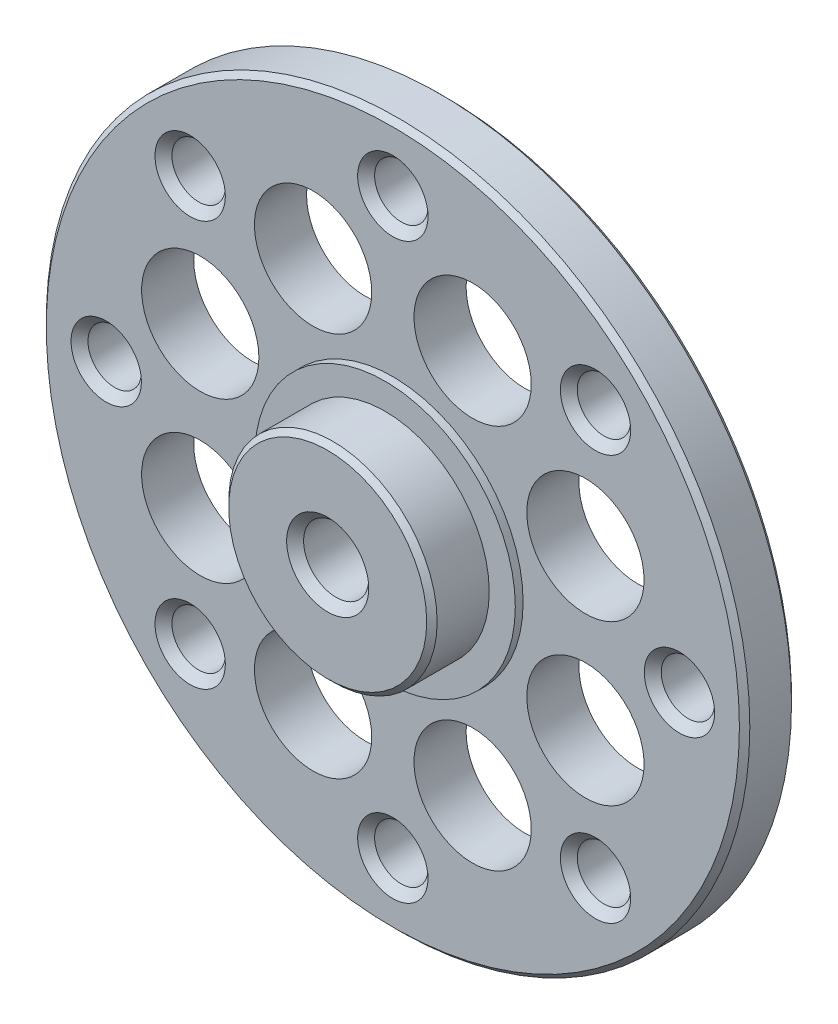
ISO-10303-21;
HEADER;
FILE_DESCRIPTION(('STEP AP214'),'2;1');
FILE_NAME('part.step','',(''),(''),'','','');
FILE_SCHEMA(('AUTOMOTIVE_DESIGN { 1 0 10303 214 1 1 1 1 }'));
ENDSEC;
DATA;
#1=APPLICATION_CONTEXT('core data for automotive mechanical design processes');
#2=APPLICATION_PROTOCOL_DEFINITION('international standard','automotive_design',2000,#1);
#3=PRODUCT_CONTEXT('',#1,'mechanical');
#4=PRODUCT('Part','Part','',(#3));
#5=PRODUCT_RELATED_PRODUCT_CATEGORY('part','',(#4));
#6=PRODUCT_DEFINITION_FORMATION('','',#4);
#7=PRODUCT_DEFINITION_CONTEXT('part definition',#1,'design');
#8=PRODUCT_DEFINITION('design','',#6,#7);
#9=PRODUCT_DEFINITION_SHAPE('','',#8);
#10=(LENGTH_UNIT() NAMED_UNIT(*) SI_UNIT(.MILLI.,.METRE.));
#11=(NAMED_UNIT(*) PLANE_ANGLE_UNIT() SI_UNIT($,.RADIAN.));
#12=(NAMED_UNIT(*) SI_UNIT($,.STERADIAN.) SOLID_ANGLE_UNIT());
#13=UNCERTAINTY_MEASURE_WITH_UNIT(LENGTH_MEASURE(1.E-05),#10,'distance_accuracy_value','');
#14=(GEOMETRIC_REPRESENTATION_CONTEXT(3) GLOBAL_UNCERTAINTY_ASSIGNED_CONTEXT((#13)) GLOBAL_UNIT_ASSIGNED_CONTEXT((#10,
#11,#12)) REPRESENTATION_CONTEXT('',''));
#15=CARTESIAN_POINT('',(0.,0.,0.));
#16=DIRECTION('',(0.,0.,1.));
#17=DIRECTION('',(1.,0.,0.));
#18=AXIS2_PLACEMENT_3D('',#15,#16,#17);
#19=CARTESIAN_POINT('',(0.,0.,0.));
#20=DIRECTION('',(0.,0.,1.));
#21=DIRECTION('',(1.,0.,0.));
#22=AXIS2_PLACEMENT_3D('',#19,#20,#21);
#23=CYLINDRICAL_SURFACE('',#22,13.5);
#24=CARTESIAN_POINT('',(0.,0.,1.79999884909628));
#25=DIRECTION('',(0.,0.,1.));
#26=DIRECTION('',(1.,0.,0.));
#27=AXIS2_PLACEMENT_3D('',#24,#25,#26);
#28=CIRCLE('',#27,13.5);
#29=CARTESIAN_POINT('',(13.5,0.,1.79999884909628));
#30=VERTEX_POINT('',#29);
#31=EDGE_CURVE('E56',#30,#30,#28,.F.);
#32=ORIENTED_EDGE('',*,*,#31,.T.);
#33=EDGE_LOOP('',(#32));
#34=FACE_BOUND('',#33,.T.);
#35=CARTESIAN_POINT('',(0.,0.,0.200001176919797));
#36=DIRECTION('',(0.,0.,-1.));
#37=DIRECTION('',(-1.,0.,0.));
#38=AXIS2_PLACEMENT_3D('',#35,#36,#37);
#39=CIRCLE('',#38,13.5);
#40=CARTESIAN_POINT('',(-13.5,0.,0.200001176919797));
#41=VERTEX_POINT('',#40);
#42=EDGE_CURVE('E59',#41,#41,#39,.F.);
#43=ORIENTED_EDGE('',*,*,#42,.T.);
#44=EDGE_LOOP('',(#43));
#45=FACE_BOUND('',#44,.T.);
#46=ADVANCED_FACE('F33',(#34,#45),#23,.T.);
#47=CARTESIAN_POINT('',(13.5,0.,0.));
#48=DIRECTION('',(0.,0.,-1.));
#49=DIRECTION('',(-1.,0.,0.));
#50=AXIS2_PLACEMENT_3D('',#47,#48,#49);
#51=PLANE('',#50);
#52=CARTESIAN_POINT('',(0.,0.,0.));
#53=DIRECTION('',(0.,0.,-1.));
#54=DIRECTION('',(-1.,0.,0.));
#55=AXIS2_PLACEMENT_3D('',#52,#53,#54);
#56=CIRCLE('',#55,13.2999988490963);
#57=CARTESIAN_POINT('',(-13.2999988490963,0.,0.));
#58=VERTEX_POINT('',#57);
#59=EDGE_CURVE('E53',#58,#58,#56,.T.);
#60=ORIENTED_EDGE('',*,*,#59,.T.);
#61=EDGE_LOOP('',(#60));
#62=FACE_BOUND('',#61,.T.);
#63=CARTESIAN_POINT('',(7.778174593052,7.778174593052,0.));
#64=DIRECTION('',(0.,0.,-1.));
#65=DIRECTION('',(-1.,0.,0.));
#66=AXIS2_PLACEMENT_3D('',#63,#64,#65);
#67=CIRCLE('',#66,1.02499999999999);
#68=CARTESIAN_POINT('',(6.75317459305201,7.778174593052,0.));
#69=VERTEX_POINT('',#68);
#70=EDGE_CURVE('E124',#69,#69,#67,.T.);
#71=ORIENTED_EDGE('',*,*,#70,.F.);
#72=EDGE_LOOP('',(#71));
#73=FACE_BOUND('',#72,.T.);
#74=CARTESIAN_POINT('',(11.,0.,0.));
#75=DIRECTION('',(0.,0.,-1.));
#76=DIRECTION('',(-1.,0.,0.));
#77=AXIS2_PLACEMENT_3D('',#74,#75,#76);
#78=CIRCLE('',#77,1.02499999999999);
#79=CARTESIAN_POINT('',(9.97500000000001,0.,0.));
#80=VERTEX_POINT('',#79);
#81=EDGE_CURVE('E120',#80,#80,#78,.T.);
#82=ORIENTED_EDGE('',*,*,#81,.F.);
#83=EDGE_LOOP('',(#82));
#84=FACE_BOUND('',#83,.T.);
#85=CARTESIAN_POINT('',(7.778174593052,-7.778174593052,0.));
#86=DIRECTION('',(0.,0.,-1.));
#87=DIRECTION('',(-1.,0.,0.));
#88=AXIS2_PLACEMENT_3D('',#85,#86,#87);
#89=CIRCLE('',#88,1.02499999999999);
#90=CARTESIAN_POINT('',(6.75317459305201,-7.778174593052,0.));
#91=VERTEX_POINT('',#90);
#92=EDGE_CURVE('E123',#91,#91,#89,.T.);
#93=ORIENTED_EDGE('',*,*,#92,.F.);
#94=EDGE_LOOP('',(#93));
#95=FACE_BOUND('',#94,.T.);
#96=CARTESIAN_POINT('',(0.,-11.,0.));
#97=DIRECTION('',(0.,0.,-1.));
#98=DIRECTION('',(-1.,0.,0.));
#99=AXIS2_PLACEMENT_3D('',#96,#97,#98);
#100=CIRCLE('',#99,1.02499999999999);
#101=CARTESIAN_POINT('',(-1.02499999999999,-11.,0.));
#102=VERTEX_POINT('',#101);
#103=EDGE_CURVE('E196',#102,#102,#100,.T.);
#104=ORIENTED_EDGE('',*,*,#103,.F.);
#105=EDGE_LOOP('',(#104));
#106=FACE_BOUND('',#105,.T.);
#107=CARTESIAN_POINT('',(-7.778174593052,-7.778174593052,0.));
#108=DIRECTION('',(0.,0.,-1.));
#109=DIRECTION('',(-1.,0.,0.));
#110=AXIS2_PLACEMENT_3D('',#107,#108,#109);
#111=CIRCLE('',#110,1.02499999999999);
#112=CARTESIAN_POINT('',(-8.80317459305199,-7.778174593052,0.));
#113=VERTEX_POINT('',#112);
#114=EDGE_CURVE('E129',#113,#113,#111,.T.);
#115=ORIENTED_EDGE('',*,*,#114,.F.);
#116=EDGE_LOOP('',(#115));
#117=FACE_BOUND('',#116,.T.);
#118=CARTESIAN_POINT('',(-11.,0.,0.));
#119=DIRECTION('',(0.,0.,-1.));
#120=DIRECTION('',(-1.,0.,0.));
#121=AXIS2_PLACEMENT_3D('',#118,#119,#120);
#122=CIRCLE('',#121,1.02499999999999);
#123=CARTESIAN_POINT('',(-12.025,0.,0.));
#124=VERTEX_POINT('',#123);
#125=EDGE_CURVE('E125',#124,#124,#122,.T.);
#126=ORIENTED_EDGE('',*,*,#125,.F.);
#127=EDGE_LOOP('',(#126));
#128=FACE_BOUND('',#127,.T.);
#129=CARTESIAN_POINT('',(-7.778174593052,7.778174593052,0.));
#130=DIRECTION('',(0.,0.,-1.));
#131=DIRECTION('',(-1.,0.,0.));
#132=AXIS2_PLACEMENT_3D('',#129,#130,#131);
#133=CIRCLE('',#132,1.02499999999999);
#134=CARTESIAN_POINT('',(-8.80317459305199,7.778174593052,0.));
#135=VERTEX_POINT('',#134);
#136=EDGE_CURVE('E128',#135,#135,#133,.T.);
#137=ORIENTED_EDGE('',*,*,#136,.F.);
#138=EDGE_LOOP('',(#137));
#139=FACE_BOUND('',#138,.T.);
#140=CARTESIAN_POINT('',(0.,11.,0.));
#141=DIRECTION('',(0.,0.,-1.));
#142=DIRECTION('',(-1.,0.,0.));
#143=AXIS2_PLACEMENT_3D('',#140,#141,#142);
#144=CIRCLE('',#143,1.02499999999999);
#145=CARTESIAN_POINT('',(-1.02499999999999,11.,0.));
#146=VERTEX_POINT('',#145);
#147=EDGE_CURVE('E189',#146,#146,#144,.T.);
#148=ORIENTED_EDGE('',*,*,#147,.F.);
#149=EDGE_LOOP('',(#148));
#150=FACE_BOUND('',#149,.T.);
#151=CARTESIAN_POINT('',(3.061467458921,7.39103626009,0.));
#152=DIRECTION('',(0.,0.,-1.));
#153=DIRECTION('',(-1.,0.,0.));
#154=AXIS2_PLACEMENT_3D('',#151,#152,#153);
#155=CIRCLE('',#154,2.24999999999999);
#156=CARTESIAN_POINT('',(0.811467458921012,7.39103626009,0.));
#157=VERTEX_POINT('',#156);
#158=EDGE_CURVE('E183',#157,#157,#155,.T.);
#159=ORIENTED_EDGE('',*,*,#158,.F.);
#160=EDGE_LOOP('',(#159));
#161=FACE_BOUND('',#160,.T.);
#162=CARTESIAN_POINT('',(7.39103626009,3.061467458921,0.));
#163=DIRECTION('',(0.,0.,-1.));
#164=DIRECTION('',(-1.,0.,0.));
#165=AXIS2_PLACEMENT_3D('',#162,#163,#164);
#166=CIRCLE('',#165,2.24999999999999);
#167=CARTESIAN_POINT('',(5.14103626009001,3.061467458921,0.));
#168=VERTEX_POINT('',#167);
#169=EDGE_CURVE('E177',#168,#168,#166,.T.);
#170=ORIENTED_EDGE('',*,*,#169,.F.);
#171=EDGE_LOOP('',(#170));
#172=FACE_BOUND('',#171,.T.);
#173=CARTESIAN_POINT('',(7.39103626009,-3.061467458921,0.));
#174=DIRECTION('',(0.,0.,-1.));
#175=DIRECTION('',(-1.,0.,0.));
#176=AXIS2_PLACEMENT_3D('',#173,#174,#175);
#177=CIRCLE('',#176,2.24999999999999);
#178=CARTESIAN_POINT('',(5.14103626009001,-3.061467458921,0.));
#179=VERTEX_POINT('',#178);
#180=EDGE_CURVE('E171',#179,#179,#177,.T.);
#181=ORIENTED_EDGE('',*,*,#180,.F.);
#182=EDGE_LOOP('',(#181));
#183=FACE_BOUND('',#182,.T.);
#184=CARTESIAN_POINT('',(3.061467458921,-7.39103626009,0.));
#185=DIRECTION('',(0.,0.,-1.));
#186=DIRECTION('',(-1.,0.,0.));
#187=AXIS2_PLACEMENT_3D('',#184,#185,#186);
#188=CIRCLE('',#187,2.24999999999999);
#189=CARTESIAN_POINT('',(0.811467458921012,-7.39103626009,0.));
#190=VERTEX_POINT('',#189);
#191=EDGE_CURVE('E165',#190,#190,#188,.T.);
#192=ORIENTED_EDGE('',*,*,#191,.F.);
#193=EDGE_LOOP('',(#192));
#194=FACE_BOUND('',#193,.T.);
#195=CARTESIAN_POINT('',(-3.061467458921,-7.39103626009,0.));
#196=DIRECTION('',(0.,0.,-1.));
#197=DIRECTION('',(-1.,0.,0.));
#198=AXIS2_PLACEMENT_3D('',#195,#196,#197);
#199=CIRCLE('',#198,2.24999999999999);
#200=CARTESIAN_POINT('',(-5.31146745892099,-7.39103626009,0.));
#201=VERTEX_POINT('',#200);
#202=EDGE_CURVE('E159',#201,#201,#199,.T.);
#203=ORIENTED_EDGE('',*,*,#202,.F.);
#204=EDGE_LOOP('',(#203));
#205=FACE_BOUND('',#204,.T.);
#206=CARTESIAN_POINT('',(-7.39103626009,-3.061467458921,0.));
#207=DIRECTION('',(0.,0.,-1.));
#208=DIRECTION('',(-1.,0.,0.));
#209=AXIS2_PLACEMENT_3D('',#206,#207,#208);
#210=CIRCLE('',#209,2.24999999999999);
#211=CARTESIAN_POINT('',(-9.64103626008999,-3.061467458921,0.));
#212=VERTEX_POINT('',#211);
#213=EDGE_CURVE('E153',#212,#212,#210,.T.);
#214=ORIENTED_EDGE('',*,*,#213,.F.);
#215=EDGE_LOOP('',(#214));
#216=FACE_BOUND('',#215,.T.);
#217=CARTESIAN_POINT('',(-7.39103626009,3.061467458921,0.));
#218=DIRECTION('',(0.,0.,-1.));
#219=DIRECTION('',(-1.,0.,0.));
#220=AXIS2_PLACEMENT_3D('',#217,#218,#219);
#221=CIRCLE('',#220,2.24999999999999);
#222=CARTESIAN_POINT('',(-9.64103626008999,3.061467458921,0.));
#223=VERTEX_POINT('',#222);
#224=EDGE_CURVE('E147',#223,#223,#221,.T.);
#225=ORIENTED_EDGE('',*,*,#224,.F.);
#226=EDGE_LOOP('',(#225));
#227=FACE_BOUND('',#226,.T.);
#228=CARTESIAN_POINT('',(-3.061467458921,7.39103626009,0.));
#229=DIRECTION('',(0.,0.,-1.));
#230=DIRECTION('',(-1.,0.,0.));
#231=AXIS2_PLACEMENT_3D('',#228,#229,#230);
#232=CIRCLE('',#231,2.24999999999999);
#233=CARTESIAN_POINT('',(-5.31146745892099,7.39103626009,0.));
#234=VERTEX_POINT('',#233);
#235=EDGE_CURVE('E137',#234,#234,#232,.T.);
#236=ORIENTED_EDGE('',*,*,#235,.F.);
#237=EDGE_LOOP('',(#236));
#238=FACE_BOUND('',#237,.T.);
#239=CARTESIAN_POINT('',(0.,0.,0.));
#240=DIRECTION('',(0.,0.,-1.));
#241=DIRECTION('',(-1.,0.,0.));
#242=AXIS2_PLACEMENT_3D('',#239,#240,#241);
#243=CIRCLE('',#242,5.);
#244=CARTESIAN_POINT('',(-5.,0.,0.));
#245=VERTEX_POINT('',#244);
#246=EDGE_CURVE('E119',#245,#245,#243,.T.);
#247=ORIENTED_EDGE('',*,*,#246,.F.);
#248=EDGE_LOOP('',(#247));
#249=FACE_BOUND('',#248,.T.);
#250=ADVANCED_FACE('F226',(#62,#73,#84,#95,#106,#117,#128,#139,#150,#161,#172,#183,#194,#205,
#216,#227,#238,#249),#51,.T.);
#251=CARTESIAN_POINT('',(0.,0.,2.));
#252=DIRECTION('',(0.,0.,1.));
#253=DIRECTION('',(1.,0.,0.));
#254=AXIS2_PLACEMENT_3D('',#251,#252,#253);
#255=PLANE('',#254);
#256=CARTESIAN_POINT('',(0.,0.,2.));
#257=DIRECTION('',(0.,0.,1.));
#258=DIRECTION('',(1.,0.,0.));
#259=AXIS2_PLACEMENT_3D('',#256,#257,#258);
#260=CIRCLE('',#259,13.2999988230802);
#261=CARTESIAN_POINT('',(13.2999988230802,0.,2.));
#262=VERTEX_POINT('',#261);
#263=EDGE_CURVE('E62',#262,#262,#260,.T.);
#264=ORIENTED_EDGE('',*,*,#263,.T.);
#265=EDGE_LOOP('',(#264));
#266=FACE_BOUND('',#265,.T.);
#267=CARTESIAN_POINT('',(0.,-11.,2.));
#268=DIRECTION('',(0.,0.,1.));
#269=DIRECTION('',(1.,0.,0.));
#270=AXIS2_PLACEMENT_3D('',#267,#268,#269);
#271=CIRCLE('',#270,1.35000000003202);
#272=CARTESIAN_POINT('',(1.35000000003202,-11.,2.));
#273=VERTEX_POINT('',#272);
#274=EDGE_CURVE('E92',#273,#273,#271,.F.);
#275=ORIENTED_EDGE('',*,*,#274,.T.);
#276=EDGE_LOOP('',(#275));
#277=FACE_BOUND('',#276,.T.);
#278=CARTESIAN_POINT('',(0.,11.,2.));
#279=DIRECTION('',(0.,0.,1.));
#280=DIRECTION('',(1.,0.,0.));
#281=AXIS2_PLACEMENT_3D('',#278,#279,#280);
#282=CIRCLE('',#281,1.35000000003202);
#283=CARTESIAN_POINT('',(1.35000000003202,11.,2.));
#284=VERTEX_POINT('',#283);
#285=EDGE_CURVE('E95',#284,#284,#282,.F.);
#286=ORIENTED_EDGE('',*,*,#285,.T.);
#287=EDGE_LOOP('',(#286));
#288=FACE_BOUND('',#287,.T.);
#289=CARTESIAN_POINT('',(-11.,0.,2.));
#290=DIRECTION('',(0.,0.,1.));
#291=DIRECTION('',(1.,0.,0.));
#292=AXIS2_PLACEMENT_3D('',#289,#290,#291);
#293=CIRCLE('',#292,1.35000000003202);
#294=CARTESIAN_POINT('',(-9.64999999996798,0.,2.));
#295=VERTEX_POINT('',#294);
#296=EDGE_CURVE('E98',#295,#295,#293,.F.);
#297=ORIENTED_EDGE('',*,*,#296,.T.);
#298=EDGE_LOOP('',(#297));
#299=FACE_BOUND('',#298,.T.);
#300=CARTESIAN_POINT('',(-7.778174593052,-7.778174593052,2.));
#301=DIRECTION('',(0.,0.,1.));
#302=DIRECTION('',(1.,0.,0.));
#303=AXIS2_PLACEMENT_3D('',#300,#301,#302);
#304=CIRCLE('',#303,1.35000000003202);
#305=CARTESIAN_POINT('',(-6.42817459301998,-7.778174593052,2.));
#306=VERTEX_POINT('',#305);
#307=EDGE_CURVE('E101',#306,#306,#304,.F.);
#308=ORIENTED_EDGE('',*,*,#307,.T.);
#309=EDGE_LOOP('',(#308));
#310=FACE_BOUND('',#309,.T.);
#311=CARTESIAN_POINT('',(-7.778174593052,7.778174593052,2.));
#312=DIRECTION('',(0.,0.,1.));
#313=DIRECTION('',(1.,0.,0.));
#314=AXIS2_PLACEMENT_3D('',#311,#312,#313);
#315=CIRCLE('',#314,1.35000000003202);
#316=CARTESIAN_POINT('',(-6.42817459301998,7.778174593052,2.));
#317=VERTEX_POINT('',#316);
#318=EDGE_CURVE('E104',#317,#317,#315,.F.);
#319=ORIENTED_EDGE('',*,*,#318,.T.);
#320=EDGE_LOOP('',(#319));
#321=FACE_BOUND('',#320,.T.);
#322=CARTESIAN_POINT('',(7.778174593052,7.778174593052,2.));
#323=DIRECTION('',(0.,0.,1.));
#324=DIRECTION('',(1.,0.,0.));
#325=AXIS2_PLACEMENT_3D('',#322,#323,#324);
#326=CIRCLE('',#325,1.35000000003202);
#327=CARTESIAN_POINT('',(9.12817459308402,7.778174593052,2.));
#328=VERTEX_POINT('',#327);
#329=EDGE_CURVE('E107',#328,#328,#326,.F.);
#330=ORIENTED_EDGE('',*,*,#329,.T.);
#331=EDGE_LOOP('',(#330));
#332=FACE_BOUND('',#331,.T.);
#333=CARTESIAN_POINT('',(11.,0.,2.));
#334=DIRECTION('',(0.,0.,1.));
#335=DIRECTION('',(1.,0.,0.));
#336=AXIS2_PLACEMENT_3D('',#333,#334,#335);
#337=CIRCLE('',#336,1.35000000003202);
#338=CARTESIAN_POINT('',(12.350000000032,0.,2.));
#339=VERTEX_POINT('',#338);
#340=EDGE_CURVE('E110',#339,#339,#337,.F.);
#341=ORIENTED_EDGE('',*,*,#340,.T.);
#342=EDGE_LOOP('',(#341));
#343=FACE_BOUND('',#342,.T.);
#344=CARTESIAN_POINT('',(7.778174593052,-7.778174593052,2.));
#345=DIRECTION('',(0.,0.,1.));
#346=DIRECTION('',(1.,0.,0.));
#347=AXIS2_PLACEMENT_3D('',#344,#345,#346);
#348=CIRCLE('',#347,1.35000000003202);
#349=CARTESIAN_POINT('',(9.12817459308402,-7.778174593052,2.));
#350=VERTEX_POINT('',#349);
#351=EDGE_CURVE('E113',#350,#350,#348,.F.);
#352=ORIENTED_EDGE('',*,*,#351,.T.);
#353=EDGE_LOOP('',(#352));
#354=FACE_BOUND('',#353,.T.);
#355=CARTESIAN_POINT('',(3.061467458921,7.39103626009,2.));
#356=DIRECTION('',(0.,0.,1.));
#357=DIRECTION('',(1.,0.,0.));
#358=AXIS2_PLACEMENT_3D('',#355,#356,#357);
#359=CIRCLE('',#358,2.24999999999999);
#360=CARTESIAN_POINT('',(5.31146745892099,7.39103626009,2.));
#361=VERTEX_POINT('',#360);
#362=EDGE_CURVE('E186',#361,#361,#359,.T.);
#363=ORIENTED_EDGE('',*,*,#362,.F.);
#364=EDGE_LOOP('',(#363));
#365=FACE_BOUND('',#364,.T.);
#366=CARTESIAN_POINT('',(7.39103626009,3.061467458921,2.));
#367=DIRECTION('',(0.,0.,1.));
#368=DIRECTION('',(1.,0.,0.));
#369=AXIS2_PLACEMENT_3D('',#366,#367,#368);
#370=CIRCLE('',#369,2.24999999999999);
#371=CARTESIAN_POINT('',(9.64103626008999,3.061467458921,2.));
#372=VERTEX_POINT('',#371);
#373=EDGE_CURVE('E180',#372,#372,#370,.T.);
#374=ORIENTED_EDGE('',*,*,#373,.F.);
#375=EDGE_LOOP('',(#374));
#376=FACE_BOUND('',#375,.T.);
#377=CARTESIAN_POINT('',(7.39103626009,-3.061467458921,2.));
#378=DIRECTION('',(0.,0.,1.));
#379=DIRECTION('',(1.,0.,0.));
#380=AXIS2_PLACEMENT_3D('',#377,#378,#379);
#381=CIRCLE('',#380,2.24999999999999);
#382=CARTESIAN_POINT('',(9.64103626008999,-3.061467458921,2.));
#383=VERTEX_POINT('',#382);
#384=EDGE_CURVE('E174',#383,#383,#381,.T.);
#385=ORIENTED_EDGE('',*,*,#384,.F.);
#386=EDGE_LOOP('',(#385));
#387=FACE_BOUND('',#386,.T.);
#388=CARTESIAN_POINT('',(3.061467458921,-7.39103626009,2.));
#389=DIRECTION('',(0.,0.,1.));
#390=DIRECTION('',(1.,0.,0.));
#391=AXIS2_PLACEMENT_3D('',#388,#389,#390);
#392=CIRCLE('',#391,2.24999999999999);
#393=CARTESIAN_POINT('',(5.31146745892099,-7.39103626009,2.));
#394=VERTEX_POINT('',#393);
#395=EDGE_CURVE('E168',#394,#394,#392,.T.);
#396=ORIENTED_EDGE('',*,*,#395,.F.);
#397=EDGE_LOOP('',(#396));
#398=FACE_BOUND('',#397,.T.);
#399=CARTESIAN_POINT('',(-3.061467458921,-7.39103626009,2.));
#400=DIRECTION('',(0.,0.,1.));
#401=DIRECTION('',(1.,0.,0.));
#402=AXIS2_PLACEMENT_3D('',#399,#400,#401);
#403=CIRCLE('',#402,2.24999999999999);
#404=CARTESIAN_POINT('',(-0.811467458921012,-7.39103626009,2.));
#405=VERTEX_POINT('',#404);
#406=EDGE_CURVE('E162',#405,#405,#403,.T.);
#407=ORIENTED_EDGE('',*,*,#406,.F.);
#408=EDGE_LOOP('',(#407));
#409=FACE_BOUND('',#408,.T.);
#410=CARTESIAN_POINT('',(-7.39103626009,-3.061467458921,2.));
#411=DIRECTION('',(0.,0.,1.));
#412=DIRECTION('',(1.,0.,0.));
#413=AXIS2_PLACEMENT_3D('',#410,#411,#412);
#414=CIRCLE('',#413,2.24999999999999);
#415=CARTESIAN_POINT('',(-5.14103626009001,-3.061467458921,2.));
#416=VERTEX_POINT('',#415);
#417=EDGE_CURVE('E156',#416,#416,#414,.T.);
#418=ORIENTED_EDGE('',*,*,#417,.F.);
#419=EDGE_LOOP('',(#418));
#420=FACE_BOUND('',#419,.T.);
#421=CARTESIAN_POINT('',(-7.39103626009,3.061467458921,2.));
#422=DIRECTION('',(0.,0.,1.));
#423=DIRECTION('',(1.,0.,0.));
#424=AXIS2_PLACEMENT_3D('',#421,#422,#423);
#425=CIRCLE('',#424,2.24999999999999);
#426=CARTESIAN_POINT('',(-5.14103626009001,3.061467458921,2.));
#427=VERTEX_POINT('',#426);
#428=EDGE_CURVE('E150',#427,#427,#425,.T.);
#429=ORIENTED_EDGE('',*,*,#428,.F.);
#430=EDGE_LOOP('',(#429));
#431=FACE_BOUND('',#430,.T.);
#432=CARTESIAN_POINT('',(-3.061467458921,7.39103626009,2.));
#433=DIRECTION('',(0.,0.,1.));
#434=DIRECTION('',(1.,0.,0.));
#435=AXIS2_PLACEMENT_3D('',#432,#433,#434);
#436=CIRCLE('',#435,2.24999999999999);
#437=CARTESIAN_POINT('',(-0.811467458921012,7.39103626009,2.));
#438=VERTEX_POINT('',#437);
#439=EDGE_CURVE('E144',#438,#438,#436,.T.);
#440=ORIENTED_EDGE('',*,*,#439,.F.);
#441=EDGE_LOOP('',(#440));
#442=FACE_BOUND('',#441,.T.);
#443=CARTESIAN_POINT('',(0.,0.,2.));
#444=DIRECTION('',(0.,0.,1.));
#445=DIRECTION('',(1.,0.,0.));
#446=AXIS2_PLACEMENT_3D('',#443,#444,#445);
#447=CIRCLE('',#446,5.);
#448=CARTESIAN_POINT('',(5.,0.,2.));
#449=VERTEX_POINT('',#448);
#450=EDGE_CURVE('E130',#449,#449,#447,.T.);
#451=ORIENTED_EDGE('',*,*,#450,.F.);
#452=EDGE_LOOP('',(#451));
#453=FACE_BOUND('',#452,.T.);
#454=ADVANCED_FACE('F232',(#266,#277,#288,#299,#310,#321,#332,#343,#354,#365,#376,#387,#398,
#409,#420,#431,#442,#453),#255,.T.);
#455=CARTESIAN_POINT('',(0.,0.,2.3));
#456=DIRECTION('',(0.,0.,-1.));
#457=DIRECTION('',(-1.,0.,0.));
#458=AXIS2_PLACEMENT_3D('',#455,#456,#457);
#459=CYLINDRICAL_SURFACE('',#458,5.);
#460=CARTESIAN_POINT('',(0.,0.,2.3));
#461=DIRECTION('',(0.,0.,1.));
#462=DIRECTION('',(1.,0.,0.));
#463=AXIS2_PLACEMENT_3D('',#460,#461,#462);
#464=CIRCLE('',#463,5.);
#465=CARTESIAN_POINT('',(5.,0.,2.3));
#466=VERTEX_POINT('',#465);
#467=EDGE_CURVE('E134',#466,#466,#464,.T.);
#468=ORIENTED_EDGE('',*,*,#467,.F.);
#469=EDGE_LOOP('',(#468));
#470=FACE_BOUND('',#469,.T.);
#471=ORIENTED_EDGE('',*,*,#450,.T.);
#472=EDGE_LOOP('',(#471));
#473=FACE_BOUND('',#472,.T.);
#474=ADVANCED_FACE('F308',(#470,#473),#459,.T.);
#475=CARTESIAN_POINT('',(0.,0.,2.3));
#476=DIRECTION('',(0.,0.,1.));
#477=DIRECTION('',(1.,0.,0.));
#478=AXIS2_PLACEMENT_3D('',#475,#476,#477);
#479=PLANE('',#478);
#480=CARTESIAN_POINT('',(0.,0.,2.3));
#481=DIRECTION('',(0.,0.,1.));
#482=DIRECTION('',(1.,0.,0.));
#483=AXIS2_PLACEMENT_3D('',#480,#481,#482);
#484=CIRCLE('',#483,4.);
#485=CARTESIAN_POINT('',(4.,0.,2.3));
#486=VERTEX_POINT('',#485);
#487=EDGE_CURVE('E133',#486,#486,#484,.T.);
#488=ORIENTED_EDGE('',*,*,#487,.F.);
#489=EDGE_LOOP('',(#488));
#490=FACE_BOUND('',#489,.T.);
#491=ORIENTED_EDGE('',*,*,#467,.T.);
#492=EDGE_LOOP('',(#491));
#493=FACE_BOUND('',#492,.T.);
#494=ADVANCED_FACE('F301',(#490,#493),#479,.T.);
#495=CARTESIAN_POINT('',(0.,0.,4.5));
#496=DIRECTION('',(0.,0.,-1.));
#497=DIRECTION('',(-1.,0.,0.));
#498=AXIS2_PLACEMENT_3D('',#495,#496,#497);
#499=CYLINDRICAL_SURFACE('',#498,4.);
#500=CARTESIAN_POINT('',(0.,0.,4.30000000002874));
#501=DIRECTION('',(0.,0.,1.));
#502=DIRECTION('',(1.,0.,0.));
#503=AXIS2_PLACEMENT_3D('',#500,#501,#502);
#504=CIRCLE('',#503,4.);
#505=CARTESIAN_POINT('',(4.,0.,4.30000000002874));
#506=VERTEX_POINT('',#505);
#507=EDGE_CURVE('E44',#506,#506,#504,.F.);
#508=ORIENTED_EDGE('',*,*,#507,.T.);
#509=EDGE_LOOP('',(#508));
#510=FACE_BOUND('',#509,.T.);
#511=ORIENTED_EDGE('',*,*,#487,.T.);
#512=EDGE_LOOP('',(#511));
#513=FACE_BOUND('',#512,.T.);
#514=ADVANCED_FACE('F291',(#510,#513),#499,.T.);
#515=CARTESIAN_POINT('',(0.,0.,4.5));
#516=DIRECTION('',(0.,0.,1.));
#517=DIRECTION('',(1.,0.,0.));
#518=AXIS2_PLACEMENT_3D('',#515,#516,#517);
#519=PLANE('',#518);
#520=CARTESIAN_POINT('',(0.,0.,4.5));
#521=DIRECTION('',(0.,0.,1.));
#522=DIRECTION('',(1.,0.,0.));
#523=AXIS2_PLACEMENT_3D('',#520,#521,#522);
#524=CIRCLE('',#523,3.80000000002874);
#525=CARTESIAN_POINT('',(3.80000000002874,0.,4.5));
#526=VERTEX_POINT('',#525);
#527=EDGE_CURVE('E48',#526,#526,#524,.T.);
#528=ORIENTED_EDGE('',*,*,#527,.T.);
#529=EDGE_LOOP('',(#528));
#530=FACE_BOUND('',#529,.T.);
#531=CARTESIAN_POINT('',(0.,0.,4.5));
#532=DIRECTION('',(0.,0.,1.));
#533=DIRECTION('',(1.,0.,0.));
#534=AXIS2_PLACEMENT_3D('',#531,#532,#533);
#535=CIRCLE('',#534,1.57500000003202);
#536=CARTESIAN_POINT('',(1.57500000003202,0.,4.5));
#537=VERTEX_POINT('',#536);
#538=EDGE_CURVE('E80',#537,#537,#535,.F.);
#539=ORIENTED_EDGE('',*,*,#538,.T.);
#540=EDGE_LOOP('',(#539));
#541=FACE_BOUND('',#540,.T.);
#542=ADVANCED_FACE('F287',(#530,#541),#519,.T.);
#543=CARTESIAN_POINT('',(0.,0.,-0.5));
#544=DIRECTION('',(0.,0.,1.));
#545=DIRECTION('',(1.,0.,0.));
#546=AXIS2_PLACEMENT_3D('',#543,#544,#545);
#547=CYLINDRICAL_SURFACE('',#546,5.);
#548=CARTESIAN_POINT('',(0.,0.,-0.300000000028738));
#549=DIRECTION('',(0.,0.,-1.));
#550=DIRECTION('',(-1.,0.,0.));
#551=AXIS2_PLACEMENT_3D('',#548,#549,#550);
#552=CIRCLE('',#551,5.);
#553=CARTESIAN_POINT('',(-5.,0.,-0.300000000028738));
#554=VERTEX_POINT('',#553);
#555=EDGE_CURVE('E10',#554,#554,#552,.F.);
#556=ORIENTED_EDGE('',*,*,#555,.T.);
#557=EDGE_LOOP('',(#556));
#558=FACE_BOUND('',#557,.T.);
#559=ORIENTED_EDGE('',*,*,#246,.T.);
#560=EDGE_LOOP('',(#559));
#561=FACE_BOUND('',#560,.T.);
#562=ADVANCED_FACE('F290',(#558,#561),#547,.T.);
#563=CARTESIAN_POINT('',(0.,0.,-0.5));
#564=DIRECTION('',(0.,0.,-1.));
#565=DIRECTION('',(-1.,0.,0.));
#566=AXIS2_PLACEMENT_3D('',#563,#564,#565);
#567=PLANE('',#566);
#568=CARTESIAN_POINT('',(0.,0.,-0.5));
#569=DIRECTION('',(0.,0.,-1.));
#570=DIRECTION('',(-1.,0.,0.));
#571=AXIS2_PLACEMENT_3D('',#568,#569,#570);
#572=CIRCLE('',#571,4.80000000002874);
#573=CARTESIAN_POINT('',(-4.80000000002874,0.,-0.5));
#574=VERTEX_POINT('',#573);
#575=EDGE_CURVE('E40',#574,#574,#572,.T.);
#576=ORIENTED_EDGE('',*,*,#575,.T.);
#577=EDGE_LOOP('',(#576));
#578=FACE_BOUND('',#577,.T.);
#579=CARTESIAN_POINT('',(0.,0.,-0.500000000000004));
#580=DIRECTION('',(0.,0.,1.));
#581=DIRECTION('',(1.,0.,0.));
#582=AXIS2_PLACEMENT_3D('',#579,#580,#581);
#583=CIRCLE('',#582,1.24999999999999);
#584=CARTESIAN_POINT('',(1.24999999999999,0.,-0.500000000000004));
#585=VERTEX_POINT('',#584);
#586=EDGE_CURVE('E203',#585,#585,#583,.T.);
#587=ORIENTED_EDGE('',*,*,#586,.T.);
#588=EDGE_LOOP('',(#587));
#589=FACE_BOUND('',#588,.T.);
#590=ADVANCED_FACE('F207',(#578,#589),#567,.T.);
#591=CARTESIAN_POINT('',(-3.061467458921,7.39103626009,2.));
#592=DIRECTION('',(0.,0.,1.));
#593=DIRECTION('',(1.,0.,0.));
#594=AXIS2_PLACEMENT_3D('',#591,#592,#593);
#595=CYLINDRICAL_SURFACE('',#594,2.24999999999999);
#596=ORIENTED_EDGE('',*,*,#235,.T.);
#597=EDGE_LOOP('',(#596));
#598=FACE_BOUND('',#597,.T.);
#599=ORIENTED_EDGE('',*,*,#439,.T.);
#600=EDGE_LOOP('',(#599));
#601=FACE_BOUND('',#600,.T.);
#602=ADVANCED_FACE('F353',(#598,#601),#595,.F.);
#603=CARTESIAN_POINT('',(-7.39103626009,3.061467458921,2.));
#604=DIRECTION('',(0.,0.,1.));
#605=DIRECTION('',(1.,0.,0.));
#606=AXIS2_PLACEMENT_3D('',#603,#604,#605);
#607=CYLINDRICAL_SURFACE('',#606,2.24999999999999);
#608=ORIENTED_EDGE('',*,*,#224,.T.);
#609=EDGE_LOOP('',(#608));
#610=FACE_BOUND('',#609,.T.);
#611=ORIENTED_EDGE('',*,*,#428,.T.);
#612=EDGE_LOOP('',(#611));
#613=FACE_BOUND('',#612,.T.);
#614=ADVANCED_FACE('F355',(#610,#613),#607,.F.);
#615=CARTESIAN_POINT('',(-7.39103626009,-3.061467458921,2.));
#616=DIRECTION('',(0.,0.,1.));
#617=DIRECTION('',(1.,0.,0.));
#618=AXIS2_PLACEMENT_3D('',#615,#616,#617);
#619=CYLINDRICAL_SURFACE('',#618,2.24999999999999);
#620=ORIENTED_EDGE('',*,*,#213,.T.);
#621=EDGE_LOOP('',(#620));
#622=FACE_BOUND('',#621,.T.);
#623=ORIENTED_EDGE('',*,*,#417,.T.);
#624=EDGE_LOOP('',(#623));
#625=FACE_BOUND('',#624,.T.);
#626=ADVANCED_FACE('F362',(#622,#625),#619,.F.);
#627=CARTESIAN_POINT('',(-3.061467458921,-7.39103626009,2.));
#628=DIRECTION('',(0.,0.,1.));
#629=DIRECTION('',(1.,0.,0.));
#630=AXIS2_PLACEMENT_3D('',#627,#628,#629);
#631=CYLINDRICAL_SURFACE('',#630,2.24999999999999);
#632=ORIENTED_EDGE('',*,*,#202,.T.);
#633=EDGE_LOOP('',(#632));
#634=FACE_BOUND('',#633,.T.);
#635=ORIENTED_EDGE('',*,*,#406,.T.);
#636=EDGE_LOOP('',(#635));
#637=FACE_BOUND('',#636,.T.);
#638=ADVANCED_FACE('F368',(#634,#637),#631,.F.);
#639=CARTESIAN_POINT('',(3.061467458921,-7.39103626009,2.));
#640=DIRECTION('',(0.,0.,1.));
#641=DIRECTION('',(1.,0.,0.));
#642=AXIS2_PLACEMENT_3D('',#639,#640,#641);
#643=CYLINDRICAL_SURFACE('',#642,2.24999999999999);
#644=ORIENTED_EDGE('',*,*,#191,.T.);
#645=EDGE_LOOP('',(#644));
#646=FACE_BOUND('',#645,.T.);
#647=ORIENTED_EDGE('',*,*,#395,.T.);
#648=EDGE_LOOP('',(#647));
#649=FACE_BOUND('',#648,.T.);
#650=ADVANCED_FACE('F372',(#646,#649),#643,.F.);
#651=CARTESIAN_POINT('',(7.39103626009,-3.061467458921,2.));
#652=DIRECTION('',(0.,0.,1.));
#653=DIRECTION('',(1.,0.,0.));
#654=AXIS2_PLACEMENT_3D('',#651,#652,#653);
#655=CYLINDRICAL_SURFACE('',#654,2.24999999999999);
#656=ORIENTED_EDGE('',*,*,#180,.T.);
#657=EDGE_LOOP('',(#656));
#658=FACE_BOUND('',#657,.T.);
#659=ORIENTED_EDGE('',*,*,#384,.T.);
#660=EDGE_LOOP('',(#659));
#661=FACE_BOUND('',#660,.T.);
#662=ADVANCED_FACE('F376',(#658,#661),#655,.F.);
#663=CARTESIAN_POINT('',(7.39103626009,3.061467458921,2.));
#664=DIRECTION('',(0.,0.,1.));
#665=DIRECTION('',(1.,0.,0.));
#666=AXIS2_PLACEMENT_3D('',#663,#664,#665);
#667=CYLINDRICAL_SURFACE('',#666,2.24999999999999);
#668=ORIENTED_EDGE('',*,*,#169,.T.);
#669=EDGE_LOOP('',(#668));
#670=FACE_BOUND('',#669,.T.);
#671=ORIENTED_EDGE('',*,*,#373,.T.);
#672=EDGE_LOOP('',(#671));
#673=FACE_BOUND('',#672,.T.);
#674=ADVANCED_FACE('F380',(#670,#673),#667,.F.);
#675=CARTESIAN_POINT('',(3.061467458921,7.39103626009,2.));
#676=DIRECTION('',(0.,0.,1.));
#677=DIRECTION('',(1.,0.,0.));
#678=AXIS2_PLACEMENT_3D('',#675,#676,#677);
#679=CYLINDRICAL_SURFACE('',#678,2.24999999999999);
#680=ORIENTED_EDGE('',*,*,#158,.T.);
#681=EDGE_LOOP('',(#680));
#682=FACE_BOUND('',#681,.T.);
#683=ORIENTED_EDGE('',*,*,#362,.T.);
#684=EDGE_LOOP('',(#683));
#685=FACE_BOUND('',#684,.T.);
#686=ADVANCED_FACE('F384',(#682,#685),#679,.F.);
#687=CARTESIAN_POINT('',(0.,11.,2.));
#688=DIRECTION('',(0.,0.,1.));
#689=DIRECTION('',(1.,0.,0.));
#690=AXIS2_PLACEMENT_3D('',#687,#688,#689);
#691=CYLINDRICAL_SURFACE('',#690,1.02499999999999);
#692=CARTESIAN_POINT('',(0.,11.,1.67499999996797));
#693=DIRECTION('',(0.,0.,1.));
#694=DIRECTION('',(1.,0.,0.));
#695=AXIS2_PLACEMENT_3D('',#692,#693,#694);
#696=CIRCLE('',#695,1.02499999999999);
#697=CARTESIAN_POINT('',(1.02499999999999,11.,1.67499999996797));
#698=VERTEX_POINT('',#697);
#699=EDGE_CURVE('E89',#698,#698,#696,.T.);
#700=ORIENTED_EDGE('',*,*,#699,.T.);
#701=EDGE_LOOP('',(#700));
#702=FACE_BOUND('',#701,.T.);
#703=ORIENTED_EDGE('',*,*,#147,.T.);
#704=EDGE_LOOP('',(#703));
#705=FACE_BOUND('',#704,.T.);
#706=ADVANCED_FACE('F388',(#702,#705),#691,.F.);
#707=CARTESIAN_POINT('',(-7.778174593052,7.778174593052,2.));
#708=DIRECTION('',(0.,0.,1.));
#709=DIRECTION('',(1.,0.,0.));
#710=AXIS2_PLACEMENT_3D('',#707,#708,#709);
#711=CYLINDRICAL_SURFACE('',#710,1.02499999999999);
#712=CARTESIAN_POINT('',(-7.778174593052,7.778174593052,1.67499999996797));
#713=DIRECTION('',(0.,0.,1.));
#714=DIRECTION('',(1.,0.,0.));
#715=AXIS2_PLACEMENT_3D('',#712,#713,#714);
#716=CIRCLE('',#715,1.02499999999999);
#717=CARTESIAN_POINT('',(-6.75317459305201,7.778174593052,1.67499999996797));
#718=VERTEX_POINT('',#717);
#719=EDGE_CURVE('E74',#718,#718,#716,.T.);
#720=ORIENTED_EDGE('',*,*,#719,.T.);
#721=EDGE_LOOP('',(#720));
#722=FACE_BOUND('',#721,.T.);
#723=ORIENTED_EDGE('',*,*,#136,.T.);
#724=EDGE_LOOP('',(#723));
#725=FACE_BOUND('',#724,.T.);
#726=ADVANCED_FACE('F392',(#722,#725),#711,.F.);
#727=CARTESIAN_POINT('',(-11.,0.,2.));
#728=DIRECTION('',(0.,0.,1.));
#729=DIRECTION('',(1.,0.,0.));
#730=AXIS2_PLACEMENT_3D('',#727,#728,#729);
#731=CYLINDRICAL_SURFACE('',#730,1.02499999999999);
#732=CARTESIAN_POINT('',(-11.,0.,1.67499999996797));
#733=DIRECTION('',(0.,0.,1.));
#734=DIRECTION('',(1.,0.,0.));
#735=AXIS2_PLACEMENT_3D('',#732,#733,#734);
#736=CIRCLE('',#735,1.02499999999999);
#737=CARTESIAN_POINT('',(-9.97500000000001,0.,1.67499999996797));
#738=VERTEX_POINT('',#737);
#739=EDGE_CURVE('E86',#738,#738,#736,.T.);
#740=ORIENTED_EDGE('',*,*,#739,.T.);
#741=EDGE_LOOP('',(#740));
#742=FACE_BOUND('',#741,.T.);
#743=ORIENTED_EDGE('',*,*,#125,.T.);
#744=EDGE_LOOP('',(#743));
#745=FACE_BOUND('',#744,.T.);
#746=ADVANCED_FACE('F396',(#742,#745),#731,.F.);
#747=CARTESIAN_POINT('',(-7.778174593052,-7.778174593052,2.));
#748=DIRECTION('',(0.,0.,1.));
#749=DIRECTION('',(1.,0.,0.));
#750=AXIS2_PLACEMENT_3D('',#747,#748,#749);
#751=CYLINDRICAL_SURFACE('',#750,1.02499999999999);
#752=CARTESIAN_POINT('',(-7.778174593052,-7.778174593052,1.67499999996797));
#753=DIRECTION('',(0.,0.,1.));
#754=DIRECTION('',(1.,0.,0.));
#755=AXIS2_PLACEMENT_3D('',#752,#753,#754);
#756=CIRCLE('',#755,1.02499999999999);
#757=CARTESIAN_POINT('',(-6.75317459305201,-7.778174593052,1.67499999996797));
#758=VERTEX_POINT('',#757);
#759=EDGE_CURVE('E77',#758,#758,#756,.T.);
#760=ORIENTED_EDGE('',*,*,#759,.T.);
#761=EDGE_LOOP('',(#760));
#762=FACE_BOUND('',#761,.T.);
#763=ORIENTED_EDGE('',*,*,#114,.T.);
#764=EDGE_LOOP('',(#763));
#765=FACE_BOUND('',#764,.T.);
#766=ADVANCED_FACE('F400',(#762,#765),#751,.F.);
#767=CARTESIAN_POINT('',(0.,-11.,2.));
#768=DIRECTION('',(0.,0.,1.));
#769=DIRECTION('',(1.,0.,0.));
#770=AXIS2_PLACEMENT_3D('',#767,#768,#769);
#771=CYLINDRICAL_SURFACE('',#770,1.02499999999999);
#772=CARTESIAN_POINT('',(0.,-11.,1.67499999996797));
#773=DIRECTION('',(0.,0.,1.));
#774=DIRECTION('',(1.,0.,0.));
#775=AXIS2_PLACEMENT_3D('',#772,#773,#774);
#776=CIRCLE('',#775,1.02499999999999);
#777=CARTESIAN_POINT('',(1.02499999999999,-11.,1.67499999996797));
#778=VERTEX_POINT('',#777);
#779=EDGE_CURVE('E116',#778,#778,#776,.T.);
#780=ORIENTED_EDGE('',*,*,#779,.T.);
#781=EDGE_LOOP('',(#780));
#782=FACE_BOUND('',#781,.T.);
#783=ORIENTED_EDGE('',*,*,#103,.T.);
#784=EDGE_LOOP('',(#783));
#785=FACE_BOUND('',#784,.T.);
#786=ADVANCED_FACE('F404',(#782,#785),#771,.F.);
#787=CARTESIAN_POINT('',(7.778174593052,-7.778174593052,2.));
#788=DIRECTION('',(0.,0.,1.));
#789=DIRECTION('',(1.,0.,0.));
#790=AXIS2_PLACEMENT_3D('',#787,#788,#789);
#791=CYLINDRICAL_SURFACE('',#790,1.02499999999999);
#792=CARTESIAN_POINT('',(7.778174593052,-7.778174593052,1.67499999996797));
#793=DIRECTION('',(0.,0.,1.));
#794=DIRECTION('',(1.,0.,0.));
#795=AXIS2_PLACEMENT_3D('',#792,#793,#794);
#796=CIRCLE('',#795,1.02499999999999);
#797=CARTESIAN_POINT('',(8.80317459305199,-7.778174593052,1.67499999996797));
#798=VERTEX_POINT('',#797);
#799=EDGE_CURVE('E65',#798,#798,#796,.T.);
#800=ORIENTED_EDGE('',*,*,#799,.T.);
#801=EDGE_LOOP('',(#800));
#802=FACE_BOUND('',#801,.T.);
#803=ORIENTED_EDGE('',*,*,#92,.T.);
#804=EDGE_LOOP('',(#803));
#805=FACE_BOUND('',#804,.T.);
#806=ADVANCED_FACE('F408',(#802,#805),#791,.F.);
#807=CARTESIAN_POINT('',(11.,0.,2.));
#808=DIRECTION('',(0.,0.,1.));
#809=DIRECTION('',(1.,0.,0.));
#810=AXIS2_PLACEMENT_3D('',#807,#808,#809);
#811=CYLINDRICAL_SURFACE('',#810,1.02499999999999);
#812=CARTESIAN_POINT('',(11.,0.,1.67499999996797));
#813=DIRECTION('',(0.,0.,1.));
#814=DIRECTION('',(1.,0.,0.));
#815=AXIS2_PLACEMENT_3D('',#812,#813,#814);
#816=CIRCLE('',#815,1.02499999999999);
#817=CARTESIAN_POINT('',(12.025,0.,1.67499999996797));
#818=VERTEX_POINT('',#817);
#819=EDGE_CURVE('E68',#818,#818,#816,.T.);
#820=ORIENTED_EDGE('',*,*,#819,.T.);
#821=EDGE_LOOP('',(#820));
#822=FACE_BOUND('',#821,.T.);
#823=ORIENTED_EDGE('',*,*,#81,.T.);
#824=EDGE_LOOP('',(#823));
#825=FACE_BOUND('',#824,.T.);
#826=ADVANCED_FACE('F222',(#822,#825),#811,.F.);
#827=CARTESIAN_POINT('',(7.778174593052,7.778174593052,2.));
#828=DIRECTION('',(0.,0.,1.));
#829=DIRECTION('',(1.,0.,0.));
#830=AXIS2_PLACEMENT_3D('',#827,#828,#829);
#831=CYLINDRICAL_SURFACE('',#830,1.02499999999999);
#832=CARTESIAN_POINT('',(7.778174593052,7.778174593052,1.67499999996797));
#833=DIRECTION('',(0.,0.,1.));
#834=DIRECTION('',(1.,0.,0.));
#835=AXIS2_PLACEMENT_3D('',#832,#833,#834);
#836=CIRCLE('',#835,1.02499999999999);
#837=CARTESIAN_POINT('',(8.80317459305199,7.778174593052,1.67499999996797));
#838=VERTEX_POINT('',#837);
#839=EDGE_CURVE('E71',#838,#838,#836,.T.);
#840=ORIENTED_EDGE('',*,*,#839,.T.);
#841=EDGE_LOOP('',(#840));
#842=FACE_BOUND('',#841,.T.);
#843=ORIENTED_EDGE('',*,*,#70,.T.);
#844=EDGE_LOOP('',(#843));
#845=FACE_BOUND('',#844,.T.);
#846=ADVANCED_FACE('F212',(#842,#845),#831,.F.);
#847=CARTESIAN_POINT('',(0.,0.,4.5));
#848=DIRECTION('',(0.,0.,1.));
#849=DIRECTION('',(1.,0.,0.));
#850=AXIS2_PLACEMENT_3D('',#847,#848,#849);
#851=CYLINDRICAL_SURFACE('',#850,1.24999999999999);
#852=CARTESIAN_POINT('',(0.,0.,4.17499999996797));
#853=DIRECTION('',(0.,0.,1.));
#854=DIRECTION('',(1.,0.,0.));
#855=AXIS2_PLACEMENT_3D('',#852,#853,#854);
#856=CIRCLE('',#855,1.24999999999999);
#857=CARTESIAN_POINT('',(1.24999999999999,0.,4.17499999996797));
#858=VERTEX_POINT('',#857);
#859=EDGE_CURVE('E83',#858,#858,#856,.T.);
#860=ORIENTED_EDGE('',*,*,#859,.T.);
#861=EDGE_LOOP('',(#860));
#862=FACE_BOUND('',#861,.T.);
#863=ORIENTED_EDGE('',*,*,#586,.F.);
#864=EDGE_LOOP('',(#863));
#865=FACE_BOUND('',#864,.T.);
#866=ADVANCED_FACE('F209',(#862,#865),#851,.F.);
#867=CARTESIAN_POINT('',(0.,-11.,1.67499999996797));
#868=DIRECTION('',(0.,0.,1.));
#869=DIRECTION('',(1.,0.,0.));
#870=AXIS2_PLACEMENT_3D('',#867,#868,#869);
#871=CONICAL_SURFACE('',#870,1.02499999999999,0.785398163397447);
#872=ORIENTED_EDGE('',*,*,#274,.F.);
#873=EDGE_LOOP('',(#872));
#874=FACE_BOUND('',#873,.T.);
#875=ORIENTED_EDGE('',*,*,#779,.F.);
#876=EDGE_LOOP('',(#875));
#877=FACE_BOUND('',#876,.T.);
#878=ADVANCED_FACE('F211',(#874,#877),#871,.F.);
#879=CARTESIAN_POINT('',(0.,11.,1.67499999996797));
#880=DIRECTION('',(0.,0.,1.));
#881=DIRECTION('',(1.,0.,0.));
#882=AXIS2_PLACEMENT_3D('',#879,#880,#881);
#883=CONICAL_SURFACE('',#882,1.02499999999999,0.785398163397447);
#884=ORIENTED_EDGE('',*,*,#285,.F.);
#885=EDGE_LOOP('',(#884));
#886=FACE_BOUND('',#885,.T.);
#887=ORIENTED_EDGE('',*,*,#699,.F.);
#888=EDGE_LOOP('',(#887));
#889=FACE_BOUND('',#888,.T.);
#890=ADVANCED_FACE('F219',(#886,#889),#883,.F.);
#891=CARTESIAN_POINT('',(-11.,0.,1.67499999996797));
#892=DIRECTION('',(0.,0.,1.));
#893=DIRECTION('',(1.,0.,0.));
#894=AXIS2_PLACEMENT_3D('',#891,#892,#893);
#895=CONICAL_SURFACE('',#894,1.02499999999999,0.785398163397447);
#896=ORIENTED_EDGE('',*,*,#296,.F.);
#897=EDGE_LOOP('',(#896));
#898=FACE_BOUND('',#897,.T.);
#899=ORIENTED_EDGE('',*,*,#739,.F.);
#900=EDGE_LOOP('',(#899));
#901=FACE_BOUND('',#900,.T.);
#902=ADVANCED_FACE('F240',(#898,#901),#895,.F.);
#903=CARTESIAN_POINT('',(0.,0.,4.17499999996797));
#904=DIRECTION('',(0.,0.,1.));
#905=DIRECTION('',(1.,0.,0.));
#906=AXIS2_PLACEMENT_3D('',#903,#904,#905);
#907=CONICAL_SURFACE('',#906,1.24999999999999,0.78539816339745);
#908=ORIENTED_EDGE('',*,*,#538,.F.);
#909=EDGE_LOOP('',(#908));
#910=FACE_BOUND('',#909,.T.);
#911=ORIENTED_EDGE('',*,*,#859,.F.);
#912=EDGE_LOOP('',(#911));
#913=FACE_BOUND('',#912,.T.);
#914=ADVANCED_FACE('F244',(#910,#913),#907,.F.);
#915=CARTESIAN_POINT('',(-7.778174593052,-7.778174593052,1.67499999996797));
#916=DIRECTION('',(0.,0.,1.));
#917=DIRECTION('',(1.,0.,0.));
#918=AXIS2_PLACEMENT_3D('',#915,#916,#917);
#919=CONICAL_SURFACE('',#918,1.02499999999999,0.785398163397447);
#920=ORIENTED_EDGE('',*,*,#307,.F.);
#921=EDGE_LOOP('',(#920));
#922=FACE_BOUND('',#921,.T.);
#923=ORIENTED_EDGE('',*,*,#759,.F.);
#924=EDGE_LOOP('',(#923));
#925=FACE_BOUND('',#924,.T.);
#926=ADVANCED_FACE('F248',(#922,#925),#919,.F.);
#927=CARTESIAN_POINT('',(-7.778174593052,7.778174593052,1.67499999996797));
#928=DIRECTION('',(0.,0.,1.));
#929=DIRECTION('',(1.,0.,0.));
#930=AXIS2_PLACEMENT_3D('',#927,#928,#929);
#931=CONICAL_SURFACE('',#930,1.02499999999999,0.785398163397447);
#932=ORIENTED_EDGE('',*,*,#318,.F.);
#933=EDGE_LOOP('',(#932));
#934=FACE_BOUND('',#933,.T.);
#935=ORIENTED_EDGE('',*,*,#719,.F.);
#936=EDGE_LOOP('',(#935));
#937=FACE_BOUND('',#936,.T.);
#938=ADVANCED_FACE('F252',(#934,#937),#931,.F.);
#939=CARTESIAN_POINT('',(7.778174593052,7.778174593052,1.67499999996797));
#940=DIRECTION('',(0.,0.,1.));
#941=DIRECTION('',(1.,0.,0.));
#942=AXIS2_PLACEMENT_3D('',#939,#940,#941);
#943=CONICAL_SURFACE('',#942,1.02499999999999,0.785398163397447);
#944=ORIENTED_EDGE('',*,*,#329,.F.);
#945=EDGE_LOOP('',(#944));
#946=FACE_BOUND('',#945,.T.);
#947=ORIENTED_EDGE('',*,*,#839,.F.);
#948=EDGE_LOOP('',(#947));
#949=FACE_BOUND('',#948,.T.);
#950=ADVANCED_FACE('F256',(#946,#949),#943,.F.);
#951=CARTESIAN_POINT('',(11.,0.,1.67499999996797));
#952=DIRECTION('',(0.,0.,1.));
#953=DIRECTION('',(1.,0.,0.));
#954=AXIS2_PLACEMENT_3D('',#951,#952,#953);
#955=CONICAL_SURFACE('',#954,1.02499999999999,0.785398163397447);
#956=ORIENTED_EDGE('',*,*,#340,.F.);
#957=EDGE_LOOP('',(#956));
#958=FACE_BOUND('',#957,.T.);
#959=ORIENTED_EDGE('',*,*,#819,.F.);
#960=EDGE_LOOP('',(#959));
#961=FACE_BOUND('',#960,.T.);
#962=ADVANCED_FACE('F260',(#958,#961),#955,.F.);
#963=CARTESIAN_POINT('',(7.778174593052,-7.778174593052,1.67499999996797));
#964=DIRECTION('',(0.,0.,1.));
#965=DIRECTION('',(1.,0.,0.));
#966=AXIS2_PLACEMENT_3D('',#963,#964,#965);
#967=CONICAL_SURFACE('',#966,1.02499999999999,0.785398163397447);
#968=ORIENTED_EDGE('',*,*,#351,.F.);
#969=EDGE_LOOP('',(#968));
#970=FACE_BOUND('',#969,.T.);
#971=ORIENTED_EDGE('',*,*,#799,.F.);
#972=EDGE_LOOP('',(#971));
#973=FACE_BOUND('',#972,.T.);
#974=ADVANCED_FACE('F264',(#970,#973),#967,.F.);
#975=CARTESIAN_POINT('',(0.,0.,2.));
#976=DIRECTION('',(0.,0.,-1.));
#977=DIRECTION('',(-1.,0.,0.));
#978=AXIS2_PLACEMENT_3D('',#975,#976,#977);
#979=CONICAL_SURFACE('',#978,13.2999988230802,0.785398228437283);
#980=ORIENTED_EDGE('',*,*,#31,.F.);
#981=EDGE_LOOP('',(#980));
#982=FACE_BOUND('',#981,.T.);
#983=ORIENTED_EDGE('',*,*,#263,.F.);
#984=EDGE_LOOP('',(#983));
#985=FACE_BOUND('',#984,.T.);
#986=ADVANCED_FACE('F268',(#982,#985),#979,.T.);
#987=CARTESIAN_POINT('',(0.,0.,0.200001176919797));
#988=DIRECTION('',(0.,0.,1.));
#989=DIRECTION('',(1.,0.,0.));
#990=AXIS2_PLACEMENT_3D('',#987,#988,#989);
#991=CONICAL_SURFACE('',#990,13.5,0.785398098357605);
#992=ORIENTED_EDGE('',*,*,#59,.F.);
#993=EDGE_LOOP('',(#992));
#994=FACE_BOUND('',#993,.T.);
#995=ORIENTED_EDGE('',*,*,#42,.F.);
#996=EDGE_LOOP('',(#995));
#997=FACE_BOUND('',#996,.T.);
#998=ADVANCED_FACE('F272',(#994,#997),#991,.T.);
#999=CARTESIAN_POINT('',(0.,0.,4.5));
#1000=DIRECTION('',(0.,0.,-1.));
#1001=DIRECTION('',(-1.,0.,0.));
#1002=AXIS2_PLACEMENT_3D('',#999,#1000,#1001);
#1003=CONICAL_SURFACE('',#1002,3.80000000002874,0.78539816339745);
#1004=ORIENTED_EDGE('',*,*,#507,.F.);
#1005=EDGE_LOOP('',(#1004));
#1006=FACE_BOUND('',#1005,.T.);
#1007=ORIENTED_EDGE('',*,*,#527,.F.);
#1008=EDGE_LOOP('',(#1007));
#1009=FACE_BOUND('',#1008,.T.);
#1010=ADVANCED_FACE('F275',(#1006,#1009),#1003,.T.);
#1011=CARTESIAN_POINT('',(0.,0.,-0.5));
#1012=DIRECTION('',(0.,0.,1.));
#1013=DIRECTION('',(1.,0.,0.));
#1014=AXIS2_PLACEMENT_3D('',#1011,#1012,#1013);
#1015=CONICAL_SURFACE('',#1014,4.80000000002874,0.785398163397444);
#1016=ORIENTED_EDGE('',*,*,#555,.F.);
#1017=EDGE_LOOP('',(#1016));
#1018=FACE_BOUND('',#1017,.T.);
#1019=ORIENTED_EDGE('',*,*,#575,.F.);
#1020=EDGE_LOOP('',(#1019));
#1021=FACE_BOUND('',#1020,.T.);
#1022=ADVANCED_FACE('F35',(#1018,#1021),#1015,.T.);
#1023=CLOSED_SHELL('',(#46,#250,#454,#474,#494,#514,#542,#562,#590,#602,#614,#626,#638,#650,
#662,#674,#686,#706,#726,#746,#766,#786,#806,#826,#846,#866,#878,#890,#902,#914,#926,#938,#950,
#962,#974,#986,#998,#1010,#1022));
#1024=MANIFOLD_SOLID_BREP('B2',#1023);
#1025=ADVANCED_BREP_SHAPE_REPRESENTATION('',(#18,#1024),#14);
#1026=SHAPE_DEFINITION_REPRESENTATION(#9,#1025);
ENDSEC;
END-ISO-10303-21;
